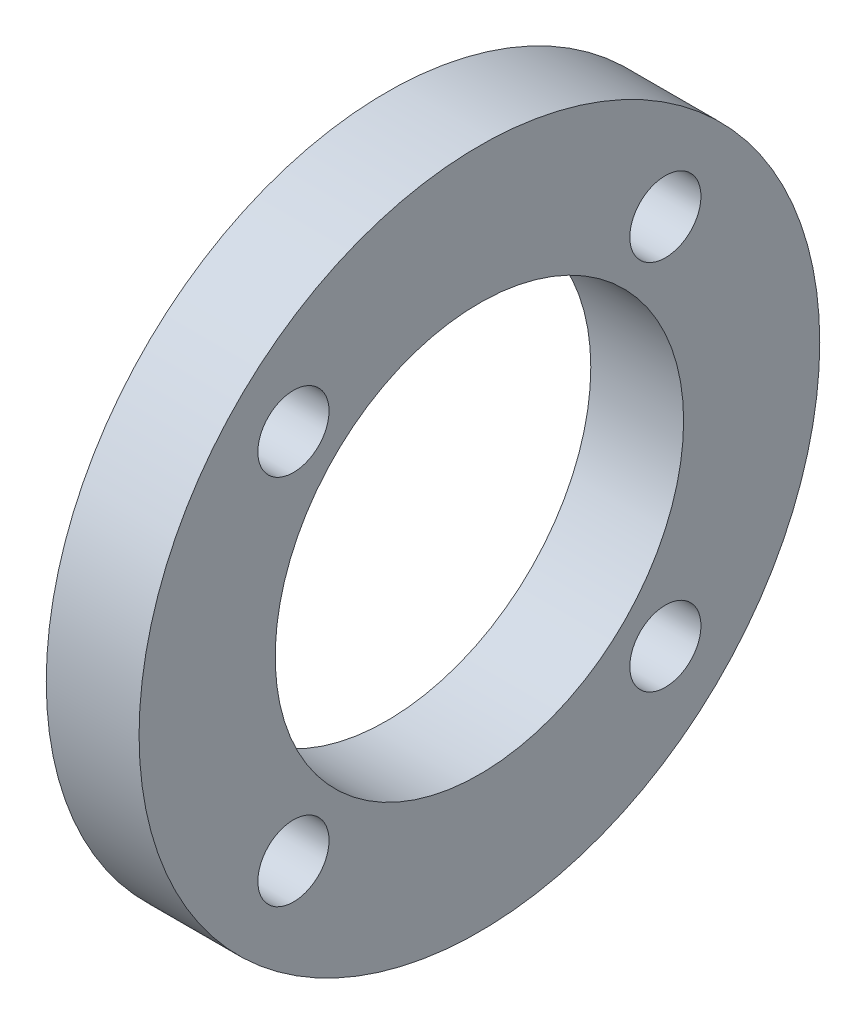
ISO-10303-21;
HEADER;
FILE_DESCRIPTION(('STEP AP214'),'2;1');
FILE_NAME('part.step','',(''),(''),'','','');
FILE_SCHEMA(('AUTOMOTIVE_DESIGN { 1 0 10303 214 1 1 1 1 }'));
ENDSEC;
DATA;
#1=APPLICATION_CONTEXT('core data for automotive mechanical design processes');
#2=APPLICATION_PROTOCOL_DEFINITION('international standard','automotive_design',2000,#1);
#3=PRODUCT_CONTEXT('',#1,'mechanical');
#4=PRODUCT('Part','Part','',(#3));
#5=PRODUCT_RELATED_PRODUCT_CATEGORY('part','',(#4));
#6=PRODUCT_DEFINITION_FORMATION('','',#4);
#7=PRODUCT_DEFINITION_CONTEXT('part definition',#1,'design');
#8=PRODUCT_DEFINITION('design','',#6,#7);
#9=PRODUCT_DEFINITION_SHAPE('','',#8);
#10=(LENGTH_UNIT() NAMED_UNIT(*) SI_UNIT(.MILLI.,.METRE.));
#11=(NAMED_UNIT(*) PLANE_ANGLE_UNIT() SI_UNIT($,.RADIAN.));
#12=(NAMED_UNIT(*) SI_UNIT($,.STERADIAN.) SOLID_ANGLE_UNIT());
#13=UNCERTAINTY_MEASURE_WITH_UNIT(LENGTH_MEASURE(1.E-05),#10,'distance_accuracy_value','');
#14=(GEOMETRIC_REPRESENTATION_CONTEXT(3) GLOBAL_UNCERTAINTY_ASSIGNED_CONTEXT((#13)) GLOBAL_UNIT_ASSIGNED_CONTEXT((#10,
#11,#12)) REPRESENTATION_CONTEXT('',''));
#15=CARTESIAN_POINT('',(0.,0.,0.));
#16=DIRECTION('',(0.,0.,1.));
#17=DIRECTION('',(1.,0.,0.));
#18=AXIS2_PLACEMENT_3D('',#15,#16,#17);
#19=CARTESIAN_POINT('',(3.,0.,0.));
#20=DIRECTION('',(1.,0.,0.));
#21=DIRECTION('',(0.,0.,-1.));
#22=AXIS2_PLACEMENT_3D('',#19,#20,#21);
#23=PLANE('',#22);
#24=CARTESIAN_POINT('',(3.,6.01040764008529,6.01040764008567));
#25=DIRECTION('',(1.,0.,0.));
#26=DIRECTION('',(0.,0.,-1.));
#27=AXIS2_PLACEMENT_3D('',#24,#25,#26);
#28=CIRCLE('',#27,1.15);
#29=CARTESIAN_POINT('',(3.,6.01040764008529,4.86040764008567));
#30=VERTEX_POINT('',#29);
#31=EDGE_CURVE('E72',#30,#30,#28,.T.);
#32=ORIENTED_EDGE('',*,*,#31,.F.);
#33=EDGE_LOOP('',(#32));
#34=FACE_BOUND('',#33,.T.);
#35=CARTESIAN_POINT('',(3.,-6.01040764008602,6.01040764008529));
#36=DIRECTION('',(1.,0.,0.));
#37=DIRECTION('',(0.,0.,-1.));
#38=AXIS2_PLACEMENT_3D('',#35,#36,#37);
#39=CIRCLE('',#38,1.15);
#40=CARTESIAN_POINT('',(3.,-6.01040764008602,4.8604076400853));
#41=VERTEX_POINT('',#40);
#42=EDGE_CURVE('E80',#41,#41,#39,.T.);
#43=ORIENTED_EDGE('',*,*,#42,.F.);
#44=EDGE_LOOP('',(#43));
#45=FACE_BOUND('',#44,.T.);
#46=CARTESIAN_POINT('',(3.,-6.01040764008564,-6.01040764008601));
#47=DIRECTION('',(1.,0.,0.));
#48=DIRECTION('',(0.,0.,-1.));
#49=AXIS2_PLACEMENT_3D('',#46,#47,#48);
#50=CIRCLE('',#49,1.15);
#51=CARTESIAN_POINT('',(3.,-6.01040764008564,-7.16040764008601));
#52=VERTEX_POINT('',#51);
#53=EDGE_CURVE('E88',#52,#52,#50,.T.);
#54=ORIENTED_EDGE('',*,*,#53,.F.);
#55=EDGE_LOOP('',(#54));
#56=FACE_BOUND('',#55,.T.);
#57=CARTESIAN_POINT('',(3.,6.01040764008567,-6.01040764008564));
#58=DIRECTION('',(1.,0.,0.));
#59=DIRECTION('',(0.,0.,-1.));
#60=AXIS2_PLACEMENT_3D('',#57,#58,#59);
#61=CIRCLE('',#60,1.15);
#62=CARTESIAN_POINT('',(3.,6.01040764008567,-7.16040764008564));
#63=VERTEX_POINT('',#62);
#64=EDGE_CURVE('E60',#63,#63,#61,.T.);
#65=ORIENTED_EDGE('',*,*,#64,.F.);
#66=EDGE_LOOP('',(#65));
#67=FACE_BOUND('',#66,.T.);
#68=CARTESIAN_POINT('',(3.,0.,0.));
#69=DIRECTION('',(1.,0.,0.));
#70=DIRECTION('',(0.,0.,-1.));
#71=AXIS2_PLACEMENT_3D('',#68,#69,#70);
#72=CIRCLE('',#71,11.);
#73=CARTESIAN_POINT('',(3.,0.,-11.));
#74=VERTEX_POINT('',#73);
#75=EDGE_CURVE('E10',#74,#74,#72,.T.);
#76=ORIENTED_EDGE('',*,*,#75,.T.);
#77=EDGE_LOOP('',(#76));
#78=FACE_BOUND('',#77,.T.);
#79=CARTESIAN_POINT('',(3.,0.,0.));
#80=DIRECTION('',(1.,0.,0.));
#81=DIRECTION('',(0.,0.,-1.));
#82=AXIS2_PLACEMENT_3D('',#79,#80,#81);
#83=CIRCLE('',#82,6.6);
#84=CARTESIAN_POINT('',(3.,0.,-6.6));
#85=VERTEX_POINT('',#84);
#86=EDGE_CURVE('E54',#85,#85,#83,.T.);
#87=ORIENTED_EDGE('',*,*,#86,.F.);
#88=EDGE_LOOP('',(#87));
#89=FACE_BOUND('',#88,.T.);
#90=ADVANCED_FACE('F41',(#34,#45,#56,#67,#78,#89),#23,.T.);
#91=CARTESIAN_POINT('',(0.,0.,0.));
#92=DIRECTION('',(1.,0.,0.));
#93=DIRECTION('',(0.,0.,-1.));
#94=AXIS2_PLACEMENT_3D('',#91,#92,#93);
#95=PLANE('',#94);
#96=CARTESIAN_POINT('',(0.,6.01040764008529,6.01040764008567));
#97=DIRECTION('',(1.,0.,0.));
#98=DIRECTION('',(0.,0.,-1.));
#99=AXIS2_PLACEMENT_3D('',#96,#97,#98);
#100=CIRCLE('',#99,1.15);
#101=CARTESIAN_POINT('',(0.,6.01040764008529,4.86040764008567));
#102=VERTEX_POINT('',#101);
#103=EDGE_CURVE('E76',#102,#102,#100,.T.);
#104=ORIENTED_EDGE('',*,*,#103,.T.);
#105=EDGE_LOOP('',(#104));
#106=FACE_BOUND('',#105,.T.);
#107=CARTESIAN_POINT('',(0.,-6.01040764008602,6.01040764008529));
#108=DIRECTION('',(1.,0.,0.));
#109=DIRECTION('',(0.,0.,-1.));
#110=AXIS2_PLACEMENT_3D('',#107,#108,#109);
#111=CIRCLE('',#110,1.15);
#112=CARTESIAN_POINT('',(0.,-6.01040764008602,4.8604076400853));
#113=VERTEX_POINT('',#112);
#114=EDGE_CURVE('E84',#113,#113,#111,.T.);
#115=ORIENTED_EDGE('',*,*,#114,.T.);
#116=EDGE_LOOP('',(#115));
#117=FACE_BOUND('',#116,.T.);
#118=CARTESIAN_POINT('',(0.,-6.01040764008564,-6.01040764008601));
#119=DIRECTION('',(1.,0.,0.));
#120=DIRECTION('',(0.,0.,-1.));
#121=AXIS2_PLACEMENT_3D('',#118,#119,#120);
#122=CIRCLE('',#121,1.15);
#123=CARTESIAN_POINT('',(0.,-6.01040764008564,-7.16040764008601));
#124=VERTEX_POINT('',#123);
#125=EDGE_CURVE('E68',#124,#124,#122,.T.);
#126=ORIENTED_EDGE('',*,*,#125,.T.);
#127=EDGE_LOOP('',(#126));
#128=FACE_BOUND('',#127,.T.);
#129=CARTESIAN_POINT('',(0.,6.01040764008567,-6.01040764008564));
#130=DIRECTION('',(1.,0.,0.));
#131=DIRECTION('',(0.,0.,-1.));
#132=AXIS2_PLACEMENT_3D('',#129,#130,#131);
#133=CIRCLE('',#132,1.15);
#134=CARTESIAN_POINT('',(0.,6.01040764008567,-7.16040764008564));
#135=VERTEX_POINT('',#134);
#136=EDGE_CURVE('E64',#135,#135,#133,.T.);
#137=ORIENTED_EDGE('',*,*,#136,.T.);
#138=EDGE_LOOP('',(#137));
#139=FACE_BOUND('',#138,.T.);
#140=CARTESIAN_POINT('',(0.,0.,0.));
#141=DIRECTION('',(1.,0.,0.));
#142=DIRECTION('',(0.,0.,-1.));
#143=AXIS2_PLACEMENT_3D('',#140,#141,#142);
#144=CIRCLE('',#143,11.);
#145=CARTESIAN_POINT('',(0.,0.,-11.));
#146=VERTEX_POINT('',#145);
#147=EDGE_CURVE('E45',#146,#146,#144,.T.);
#148=ORIENTED_EDGE('',*,*,#147,.F.);
#149=EDGE_LOOP('',(#148));
#150=FACE_BOUND('',#149,.T.);
#151=CARTESIAN_POINT('',(0.,0.,0.));
#152=DIRECTION('',(1.,0.,0.));
#153=DIRECTION('',(0.,0.,-1.));
#154=AXIS2_PLACEMENT_3D('',#151,#152,#153);
#155=CIRCLE('',#154,6.6);
#156=CARTESIAN_POINT('',(0.,0.,-6.6));
#157=VERTEX_POINT('',#156);
#158=EDGE_CURVE('E56',#157,#157,#155,.T.);
#159=ORIENTED_EDGE('',*,*,#158,.T.);
#160=EDGE_LOOP('',(#159));
#161=FACE_BOUND('',#160,.T.);
#162=ADVANCED_FACE('F96',(#106,#117,#128,#139,#150,#161),#95,.F.);
#163=CARTESIAN_POINT('',(3.,0.,0.));
#164=DIRECTION('',(-1.,0.,0.));
#165=DIRECTION('',(0.,0.,1.));
#166=AXIS2_PLACEMENT_3D('',#163,#164,#165);
#167=CYLINDRICAL_SURFACE('',#166,11.);
#168=ORIENTED_EDGE('',*,*,#75,.F.);
#169=EDGE_LOOP('',(#168));
#170=FACE_BOUND('',#169,.T.);
#171=ORIENTED_EDGE('',*,*,#147,.T.);
#172=EDGE_LOOP('',(#171));
#173=FACE_BOUND('',#172,.T.);
#174=ADVANCED_FACE('F43',(#170,#173),#167,.T.);
#175=CARTESIAN_POINT('',(3.,0.,0.));
#176=DIRECTION('',(-1.,0.,0.));
#177=DIRECTION('',(0.,0.,1.));
#178=AXIS2_PLACEMENT_3D('',#175,#176,#177);
#179=CYLINDRICAL_SURFACE('',#178,6.6);
#180=ORIENTED_EDGE('',*,*,#86,.T.);
#181=EDGE_LOOP('',(#180));
#182=FACE_BOUND('',#181,.T.);
#183=ORIENTED_EDGE('',*,*,#158,.F.);
#184=EDGE_LOOP('',(#183));
#185=FACE_BOUND('',#184,.T.);
#186=ADVANCED_FACE('F112',(#182,#185),#179,.F.);
#187=CARTESIAN_POINT('',(3.,6.01040764008567,-6.01040764008564));
#188=DIRECTION('',(-1.,0.,0.));
#189=DIRECTION('',(0.,0.,1.));
#190=AXIS2_PLACEMENT_3D('',#187,#188,#189);
#191=CYLINDRICAL_SURFACE('',#190,1.15);
#192=ORIENTED_EDGE('',*,*,#64,.T.);
#193=EDGE_LOOP('',(#192));
#194=FACE_BOUND('',#193,.T.);
#195=ORIENTED_EDGE('',*,*,#136,.F.);
#196=EDGE_LOOP('',(#195));
#197=FACE_BOUND('',#196,.T.);
#198=ADVANCED_FACE('F102',(#194,#197),#191,.F.);
#199=CARTESIAN_POINT('',(3.,-6.01040764008564,-6.01040764008601));
#200=DIRECTION('',(-1.,0.,0.));
#201=DIRECTION('',(0.,0.,1.));
#202=AXIS2_PLACEMENT_3D('',#199,#200,#201);
#203=CYLINDRICAL_SURFACE('',#202,1.15);
#204=ORIENTED_EDGE('',*,*,#53,.T.);
#205=EDGE_LOOP('',(#204));
#206=FACE_BOUND('',#205,.T.);
#207=ORIENTED_EDGE('',*,*,#125,.F.);
#208=EDGE_LOOP('',(#207));
#209=FACE_BOUND('',#208,.T.);
#210=ADVANCED_FACE('F99',(#206,#209),#203,.F.);
#211=CARTESIAN_POINT('',(3.,-6.01040764008602,6.01040764008529));
#212=DIRECTION('',(-1.,0.,0.));
#213=DIRECTION('',(0.,0.,1.));
#214=AXIS2_PLACEMENT_3D('',#211,#212,#213);
#215=CYLINDRICAL_SURFACE('',#214,1.15);
#216=ORIENTED_EDGE('',*,*,#42,.T.);
#217=EDGE_LOOP('',(#216));
#218=FACE_BOUND('',#217,.T.);
#219=ORIENTED_EDGE('',*,*,#114,.F.);
#220=EDGE_LOOP('',(#219));
#221=FACE_BOUND('',#220,.T.);
#222=ADVANCED_FACE('F101',(#218,#221),#215,.F.);
#223=CARTESIAN_POINT('',(3.,6.01040764008529,6.01040764008567));
#224=DIRECTION('',(-1.,0.,0.));
#225=DIRECTION('',(0.,0.,1.));
#226=AXIS2_PLACEMENT_3D('',#223,#224,#225);
#227=CYLINDRICAL_SURFACE('',#226,1.15);
#228=ORIENTED_EDGE('',*,*,#31,.T.);
#229=EDGE_LOOP('',(#228));
#230=FACE_BOUND('',#229,.T.);
#231=ORIENTED_EDGE('',*,*,#103,.F.);
#232=EDGE_LOOP('',(#231));
#233=FACE_BOUND('',#232,.T.);
#234=ADVANCED_FACE('F109',(#230,#233),#227,.F.);
#235=CLOSED_SHELL('',(#90,#162,#174,#186,#198,#210,#222,#234));
#236=MANIFOLD_SOLID_BREP('B2',#235);
#237=ADVANCED_BREP_SHAPE_REPRESENTATION('',(#18,#236),#14);
#238=SHAPE_DEFINITION_REPRESENTATION(#9,#237);
ENDSEC;
END-ISO-10303-21;
